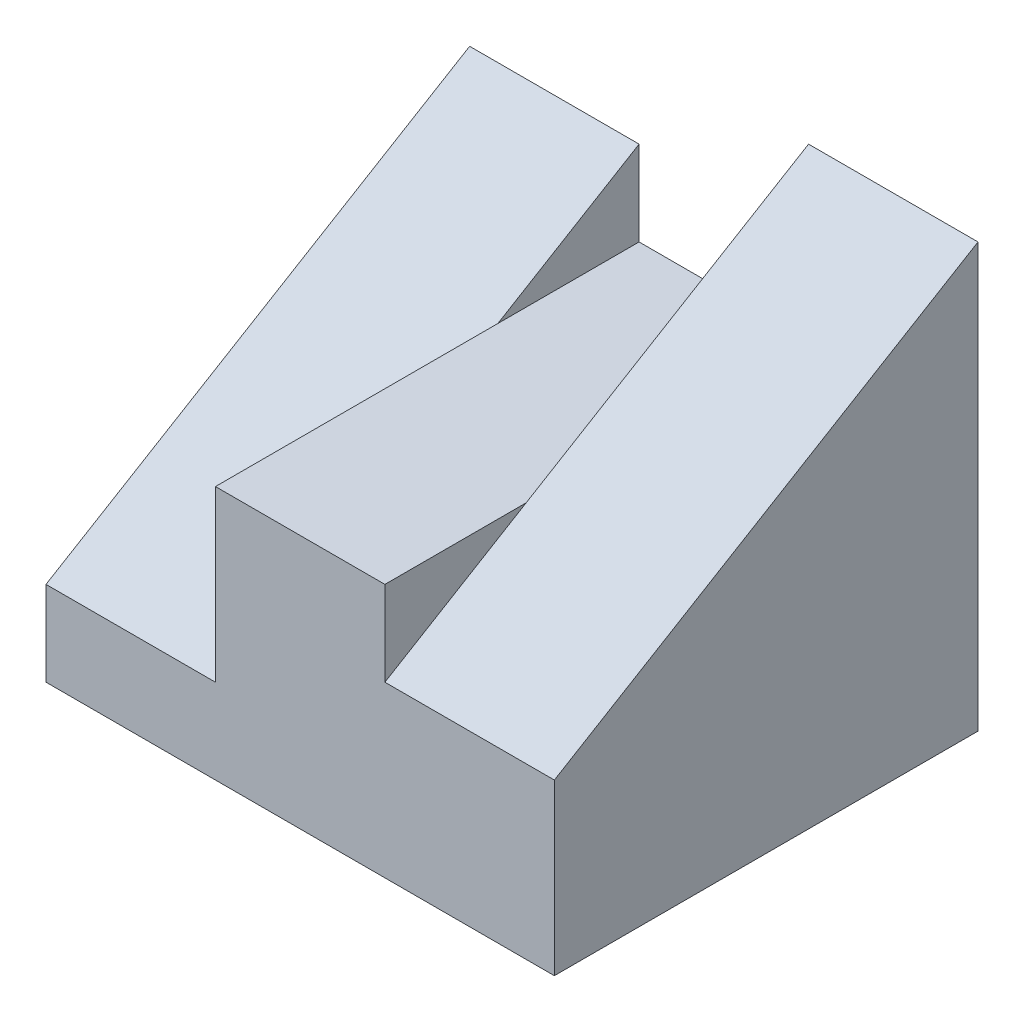
ISO-10303-21;
HEADER;
FILE_DESCRIPTION(('STEP AP214'),'2;1');
FILE_NAME('part.step','',(''),(''),'','','');
FILE_SCHEMA(('AUTOMOTIVE_DESIGN { 1 0 10303 214 1 1 1 1 }'));
ENDSEC;
DATA;
#1=APPLICATION_CONTEXT('core data for automotive mechanical design processes');
#2=APPLICATION_PROTOCOL_DEFINITION('international standard','automotive_design',2000,#1);
#3=PRODUCT_CONTEXT('',#1,'mechanical');
#4=PRODUCT('Part','Part','',(#3));
#5=PRODUCT_RELATED_PRODUCT_CATEGORY('part','',(#4));
#6=PRODUCT_DEFINITION_FORMATION('','',#4);
#7=PRODUCT_DEFINITION_CONTEXT('part definition',#1,'design');
#8=PRODUCT_DEFINITION('design','',#6,#7);
#9=PRODUCT_DEFINITION_SHAPE('','',#8);
#10=(LENGTH_UNIT() NAMED_UNIT(*) SI_UNIT(.MILLI.,.METRE.));
#11=(NAMED_UNIT(*) PLANE_ANGLE_UNIT() SI_UNIT($,.RADIAN.));
#12=(NAMED_UNIT(*) SI_UNIT($,.STERADIAN.) SOLID_ANGLE_UNIT());
#13=UNCERTAINTY_MEASURE_WITH_UNIT(LENGTH_MEASURE(1.E-05),#10,'distance_accuracy_value','');
#14=(GEOMETRIC_REPRESENTATION_CONTEXT(3) GLOBAL_UNCERTAINTY_ASSIGNED_CONTEXT((#13)) GLOBAL_UNIT_ASSIGNED_CONTEXT((#10,
#11,#12)) REPRESENTATION_CONTEXT('',''));
#15=CARTESIAN_POINT('',(0.,0.,0.));
#16=DIRECTION('',(0.,0.,1.));
#17=DIRECTION('',(1.,0.,0.));
#18=AXIS2_PLACEMENT_3D('',#15,#16,#17);
#19=CARTESIAN_POINT('',(-20.,5.,25.));
#20=DIRECTION('',(1.,0.,0.));
#21=DIRECTION('',(0.,0.,-1.));
#22=AXIS2_PLACEMENT_3D('',#19,#20,#21);
#23=PLANE('',#22);
#24=DIRECTION('',(0.,0.514495755427526,-0.857492925712544));
#25=VECTOR('',#24,1.);
#26=CARTESIAN_POINT('',(-20.,20.,0.));
#27=LINE('',#26,#25);
#28=CARTESIAN_POINT('',(-20.,5.,25.));
#29=VERTEX_POINT('',#28);
#30=CARTESIAN_POINT('',(-20.,15.,8.33333333333333));
#31=VERTEX_POINT('',#30);
#32=EDGE_CURVE('E196',#29,#31,#27,.T.);
#33=ORIENTED_EDGE('',*,*,#32,.F.);
#34=DIRECTION('',(0.,-1.,0.));
#35=VECTOR('',#34,1.);
#36=CARTESIAN_POINT('',(-20.,5.,25.));
#37=LINE('',#36,#35);
#38=CARTESIAN_POINT('',(-20.,15.,25.));
#39=VERTEX_POINT('',#38);
#40=EDGE_CURVE('E163',#39,#29,#37,.T.);
#41=ORIENTED_EDGE('',*,*,#40,.F.);
#42=DIRECTION('',(0.,0.,-1.));
#43=VECTOR('',#42,1.);
#44=CARTESIAN_POINT('',(-20.,15.,25.));
#45=LINE('',#44,#43);
#46=EDGE_CURVE('E167',#39,#31,#45,.T.);
#47=ORIENTED_EDGE('',*,*,#46,.T.);
#48=EDGE_LOOP('',(#33,#41,#47));
#49=FACE_BOUND('',#48,.T.);
#50=ADVANCED_FACE('F33',(#49),#23,.F.);
#51=CARTESIAN_POINT('',(-10.,15.,25.));
#52=DIRECTION('',(-1.,0.,0.));
#53=DIRECTION('',(0.,0.,1.));
#54=AXIS2_PLACEMENT_3D('',#51,#52,#53);
#55=PLANE('',#54);
#56=DIRECTION('',(0.,-0.514495755427526,0.857492925712544));
#57=VECTOR('',#56,1.);
#58=CARTESIAN_POINT('',(-10.,25.,0.));
#59=LINE('',#58,#57);
#60=CARTESIAN_POINT('',(-10.,15.,16.6666666666667));
#61=VERTEX_POINT('',#60);
#62=CARTESIAN_POINT('',(-10.,10.,25.));
#63=VERTEX_POINT('',#62);
#64=EDGE_CURVE('E56',#61,#63,#59,.T.);
#65=ORIENTED_EDGE('',*,*,#64,.F.);
#66=DIRECTION('',(0.,0.,-1.));
#67=VECTOR('',#66,1.);
#68=CARTESIAN_POINT('',(-10.,15.,25.));
#69=LINE('',#68,#67);
#70=CARTESIAN_POINT('',(-10.,15.,25.));
#71=VERTEX_POINT('',#70);
#72=EDGE_CURVE('E174',#71,#61,#69,.T.);
#73=ORIENTED_EDGE('',*,*,#72,.F.);
#74=DIRECTION('',(0.,1.,0.));
#75=VECTOR('',#74,1.);
#76=CARTESIAN_POINT('',(-10.,15.,25.));
#77=LINE('',#76,#75);
#78=EDGE_CURVE('E159',#63,#71,#77,.T.);
#79=ORIENTED_EDGE('',*,*,#78,.F.);
#80=EDGE_LOOP('',(#65,#73,#79));
#81=FACE_BOUND('',#80,.T.);
#82=ADVANCED_FACE('F190',(#81),#55,.F.);
#83=CARTESIAN_POINT('',(-30.,0.,25.));
#84=DIRECTION('',(1.,0.,0.));
#85=DIRECTION('',(0.,0.,-1.));
#86=AXIS2_PLACEMENT_3D('',#83,#84,#85);
#87=PLANE('',#86);
#88=DIRECTION('',(0.,-1.,0.));
#89=VECTOR('',#88,1.);
#90=CARTESIAN_POINT('',(-30.,0.,0.));
#91=LINE('',#90,#89);
#92=CARTESIAN_POINT('',(-30.,20.,0.));
#93=VERTEX_POINT('',#92);
#94=CARTESIAN_POINT('',(-30.,0.,0.));
#95=VERTEX_POINT('',#94);
#96=EDGE_CURVE('E107',#93,#95,#91,.T.);
#97=ORIENTED_EDGE('',*,*,#96,.T.);
#98=DIRECTION('',(0.,0.,-1.));
#99=VECTOR('',#98,1.);
#100=CARTESIAN_POINT('',(-30.,0.,25.));
#101=LINE('',#100,#99);
#102=CARTESIAN_POINT('',(-30.,0.,25.));
#103=VERTEX_POINT('',#102);
#104=EDGE_CURVE('E11',#103,#95,#101,.T.);
#105=ORIENTED_EDGE('',*,*,#104,.F.);
#106=DIRECTION('',(0.,-1.,0.));
#107=VECTOR('',#106,1.);
#108=CARTESIAN_POINT('',(-30.,0.,25.));
#109=LINE('',#108,#107);
#110=CARTESIAN_POINT('',(-30.,5.,25.));
#111=VERTEX_POINT('',#110);
#112=EDGE_CURVE('E124',#111,#103,#109,.T.);
#113=ORIENTED_EDGE('',*,*,#112,.F.);
#114=DIRECTION('',(0.,0.514495755427526,-0.857492925712544));
#115=VECTOR('',#114,1.);
#116=CARTESIAN_POINT('',(-30.,20.,0.));
#117=LINE('',#116,#115);
#118=EDGE_CURVE('E122',#111,#93,#117,.T.);
#119=ORIENTED_EDGE('',*,*,#118,.T.);
#120=EDGE_LOOP('',(#97,#105,#113,#119));
#121=FACE_BOUND('',#120,.T.);
#122=ADVANCED_FACE('F35',(#121),#87,.F.);
#123=CARTESIAN_POINT('',(0.,0.,25.));
#124=DIRECTION('',(0.,1.,0.));
#125=DIRECTION('',(-1.,0.,0.));
#126=AXIS2_PLACEMENT_3D('',#123,#124,#125);
#127=PLANE('',#126);
#128=DIRECTION('',(1.,0.,0.));
#129=VECTOR('',#128,1.);
#130=CARTESIAN_POINT('',(0.,0.,0.));
#131=LINE('',#130,#129);
#132=CARTESIAN_POINT('',(0.,0.,0.));
#133=VERTEX_POINT('',#132);
#134=EDGE_CURVE('E115',#95,#133,#131,.T.);
#135=ORIENTED_EDGE('',*,*,#134,.T.);
#136=DIRECTION('',(0.,0.,-1.));
#137=VECTOR('',#136,1.);
#138=CARTESIAN_POINT('',(0.,0.,25.));
#139=LINE('',#138,#137);
#140=CARTESIAN_POINT('',(0.,0.,25.));
#141=VERTEX_POINT('',#140);
#142=EDGE_CURVE('E41',#141,#133,#139,.T.);
#143=ORIENTED_EDGE('',*,*,#142,.F.);
#144=DIRECTION('',(1.,0.,0.));
#145=VECTOR('',#144,1.);
#146=CARTESIAN_POINT('',(0.,0.,25.));
#147=LINE('',#146,#145);
#148=EDGE_CURVE('E152',#103,#141,#147,.T.);
#149=ORIENTED_EDGE('',*,*,#148,.F.);
#150=ORIENTED_EDGE('',*,*,#104,.T.);
#151=EDGE_LOOP('',(#135,#143,#149,#150));
#152=FACE_BOUND('',#151,.T.);
#153=ADVANCED_FACE('F220',(#152),#127,.F.);
#154=CARTESIAN_POINT('',(0.,10.,25.));
#155=DIRECTION('',(-1.,0.,0.));
#156=DIRECTION('',(0.,-1.,0.));
#157=AXIS2_PLACEMENT_3D('',#154,#155,#156);
#158=PLANE('',#157);
#159=DIRECTION('',(0.,1.,0.));
#160=VECTOR('',#159,1.);
#161=CARTESIAN_POINT('',(0.,10.,0.));
#162=LINE('',#161,#160);
#163=CARTESIAN_POINT('',(0.,25.,0.));
#164=VERTEX_POINT('',#163);
#165=EDGE_CURVE('E170',#133,#164,#162,.T.);
#166=ORIENTED_EDGE('',*,*,#165,.T.);
#167=DIRECTION('',(0.,-0.514495755427526,0.857492925712544));
#168=VECTOR('',#167,1.);
#169=CARTESIAN_POINT('',(0.,25.,0.));
#170=LINE('',#169,#168);
#171=CARTESIAN_POINT('',(0.,10.,25.));
#172=VERTEX_POINT('',#171);
#173=EDGE_CURVE('E138',#164,#172,#170,.T.);
#174=ORIENTED_EDGE('',*,*,#173,.T.);
#175=DIRECTION('',(0.,1.,0.));
#176=VECTOR('',#175,1.);
#177=CARTESIAN_POINT('',(0.,10.,25.));
#178=LINE('',#177,#176);
#179=EDGE_CURVE('E155',#141,#172,#178,.T.);
#180=ORIENTED_EDGE('',*,*,#179,.F.);
#181=ORIENTED_EDGE('',*,*,#142,.T.);
#182=EDGE_LOOP('',(#166,#174,#180,#181));
#183=FACE_BOUND('',#182,.T.);
#184=ADVANCED_FACE('F179',(#183),#158,.F.);
#185=CARTESIAN_POINT('',(-20.,15.,25.));
#186=DIRECTION('',(0.,-1.,0.));
#187=DIRECTION('',(0.,0.,-1.));
#188=AXIS2_PLACEMENT_3D('',#185,#186,#187);
#189=PLANE('',#188);
#190=DIRECTION('',(-1.,0.,0.));
#191=VECTOR('',#190,1.);
#192=CARTESIAN_POINT('',(-20.,15.,0.));
#193=LINE('',#192,#191);
#194=CARTESIAN_POINT('',(-10.,15.,0.));
#195=VERTEX_POINT('',#194);
#196=CARTESIAN_POINT('',(-20.,15.,0.));
#197=VERTEX_POINT('',#196);
#198=EDGE_CURVE('E153',#195,#197,#193,.T.);
#199=ORIENTED_EDGE('',*,*,#198,.T.);
#200=DIRECTION('',(0.,0.,1.));
#201=VECTOR('',#200,1.);
#202=CARTESIAN_POINT('',(-20.,15.,25.));
#203=LINE('',#202,#201);
#204=EDGE_CURVE('E48',#197,#31,#203,.T.);
#205=ORIENTED_EDGE('',*,*,#204,.T.);
#206=ORIENTED_EDGE('',*,*,#46,.F.);
#207=DIRECTION('',(-1.,0.,0.));
#208=VECTOR('',#207,1.);
#209=CARTESIAN_POINT('',(-20.,15.,25.));
#210=LINE('',#209,#208);
#211=EDGE_CURVE('E161',#71,#39,#210,.T.);
#212=ORIENTED_EDGE('',*,*,#211,.F.);
#213=ORIENTED_EDGE('',*,*,#72,.T.);
#214=DIRECTION('',(0.,0.,-1.));
#215=VECTOR('',#214,1.);
#216=CARTESIAN_POINT('',(-10.,15.,25.));
#217=LINE('',#216,#215);
#218=EDGE_CURVE('E118',#61,#195,#217,.T.);
#219=ORIENTED_EDGE('',*,*,#218,.T.);
#220=EDGE_LOOP('',(#199,#205,#206,#212,#213,#219));
#221=FACE_BOUND('',#220,.T.);
#222=ADVANCED_FACE('F193',(#221),#189,.F.);
#223=CARTESIAN_POINT('',(0.,0.,25.));
#224=DIRECTION('',(0.,0.,-1.));
#225=DIRECTION('',(-1.,0.,0.));
#226=AXIS2_PLACEMENT_3D('',#223,#224,#225);
#227=PLANE('',#226);
#228=ORIENTED_EDGE('',*,*,#112,.T.);
#229=ORIENTED_EDGE('',*,*,#148,.T.);
#230=ORIENTED_EDGE('',*,*,#179,.T.);
#231=DIRECTION('',(-1.,0.,0.));
#232=VECTOR('',#231,1.);
#233=CARTESIAN_POINT('',(-10.,10.,25.));
#234=LINE('',#233,#232);
#235=EDGE_CURVE('E157',#172,#63,#234,.T.);
#236=ORIENTED_EDGE('',*,*,#235,.T.);
#237=ORIENTED_EDGE('',*,*,#78,.T.);
#238=ORIENTED_EDGE('',*,*,#211,.T.);
#239=ORIENTED_EDGE('',*,*,#40,.T.);
#240=DIRECTION('',(-1.,0.,0.));
#241=VECTOR('',#240,1.);
#242=CARTESIAN_POINT('',(-30.,5.,25.));
#243=LINE('',#242,#241);
#244=EDGE_CURVE('E166',#29,#111,#243,.T.);
#245=ORIENTED_EDGE('',*,*,#244,.T.);
#246=EDGE_LOOP('',(#228,#229,#230,#236,#237,#238,#239,#245));
#247=FACE_BOUND('',#246,.T.);
#248=ADVANCED_FACE('F189',(#247),#227,.F.);
#249=CARTESIAN_POINT('',(0.,0.,0.));
#250=DIRECTION('',(0.,0.,-1.));
#251=DIRECTION('',(-1.,0.,0.));
#252=AXIS2_PLACEMENT_3D('',#249,#250,#251);
#253=PLANE('',#252);
#254=ORIENTED_EDGE('',*,*,#96,.F.);
#255=DIRECTION('',(1.,0.,0.));
#256=VECTOR('',#255,1.);
#257=CARTESIAN_POINT('',(-30.,20.,0.));
#258=LINE('',#257,#256);
#259=CARTESIAN_POINT('',(-20.,20.,0.));
#260=VERTEX_POINT('',#259);
#261=EDGE_CURVE('E112',#93,#260,#258,.T.);
#262=ORIENTED_EDGE('',*,*,#261,.T.);
#263=DIRECTION('',(0.,-1.,0.));
#264=VECTOR('',#263,1.);
#265=CARTESIAN_POINT('',(-20.,5.,0.));
#266=LINE('',#265,#264);
#267=EDGE_CURVE('E127',#260,#197,#266,.T.);
#268=ORIENTED_EDGE('',*,*,#267,.T.);
#269=ORIENTED_EDGE('',*,*,#198,.F.);
#270=DIRECTION('',(0.,1.,0.));
#271=VECTOR('',#270,1.);
#272=CARTESIAN_POINT('',(-10.,10.,0.));
#273=LINE('',#272,#271);
#274=CARTESIAN_POINT('',(-10.,25.,0.));
#275=VERTEX_POINT('',#274);
#276=EDGE_CURVE('E142',#195,#275,#273,.T.);
#277=ORIENTED_EDGE('',*,*,#276,.T.);
#278=DIRECTION('',(-1.,0.,0.));
#279=VECTOR('',#278,1.);
#280=CARTESIAN_POINT('',(0.,25.,0.));
#281=LINE('',#280,#279);
#282=EDGE_CURVE('E141',#164,#275,#281,.T.);
#283=ORIENTED_EDGE('',*,*,#282,.F.);
#284=ORIENTED_EDGE('',*,*,#165,.F.);
#285=ORIENTED_EDGE('',*,*,#134,.F.);
#286=EDGE_LOOP('',(#254,#262,#268,#269,#277,#283,#284,#285));
#287=FACE_BOUND('',#286,.T.);
#288=ADVANCED_FACE('F109',(#287),#253,.T.);
#289=CARTESIAN_POINT('',(-10.,0.,0.));
#290=DIRECTION('',(-1.,0.,0.));
#291=DIRECTION('',(0.,0.,1.));
#292=AXIS2_PLACEMENT_3D('',#289,#290,#291);
#293=PLANE('',#292);
#294=ORIENTED_EDGE('',*,*,#218,.F.);
#295=EDGE_CURVE('E143',#275,#61,#59,.T.);
#296=ORIENTED_EDGE('',*,*,#295,.F.);
#297=ORIENTED_EDGE('',*,*,#276,.F.);
#298=EDGE_LOOP('',(#294,#296,#297));
#299=FACE_BOUND('',#298,.T.);
#300=ADVANCED_FACE('F206',(#299),#293,.T.);
#301=CARTESIAN_POINT('',(0.,25.,0.));
#302=DIRECTION('',(0.,-0.857492925712544,-0.514495755427526));
#303=DIRECTION('',(0.,0.514495755427526,-0.857492925712544));
#304=AXIS2_PLACEMENT_3D('',#301,#302,#303);
#305=PLANE('',#304);
#306=ORIENTED_EDGE('',*,*,#295,.T.);
#307=ORIENTED_EDGE('',*,*,#64,.T.);
#308=ORIENTED_EDGE('',*,*,#235,.F.);
#309=ORIENTED_EDGE('',*,*,#173,.F.);
#310=ORIENTED_EDGE('',*,*,#282,.T.);
#311=EDGE_LOOP('',(#306,#307,#308,#309,#310));
#312=FACE_BOUND('',#311,.T.);
#313=ADVANCED_FACE('F187',(#312),#305,.F.);
#314=CARTESIAN_POINT('',(-20.,0.,0.));
#315=DIRECTION('',(1.,0.,0.));
#316=DIRECTION('',(0.,0.,-1.));
#317=AXIS2_PLACEMENT_3D('',#314,#315,#316);
#318=PLANE('',#317);
#319=ORIENTED_EDGE('',*,*,#204,.F.);
#320=ORIENTED_EDGE('',*,*,#267,.F.);
#321=EDGE_CURVE('E132',#31,#260,#27,.T.);
#322=ORIENTED_EDGE('',*,*,#321,.F.);
#323=EDGE_LOOP('',(#319,#320,#322));
#324=FACE_BOUND('',#323,.T.);
#325=ADVANCED_FACE('F198',(#324),#318,.T.);
#326=CARTESIAN_POINT('',(-30.,20.,0.));
#327=DIRECTION('',(0.,-0.857492925712544,-0.514495755427526));
#328=DIRECTION('',(0.,0.514495755427526,-0.857492925712544));
#329=AXIS2_PLACEMENT_3D('',#326,#327,#328);
#330=PLANE('',#329);
#331=ORIENTED_EDGE('',*,*,#32,.T.);
#332=ORIENTED_EDGE('',*,*,#321,.T.);
#333=ORIENTED_EDGE('',*,*,#261,.F.);
#334=ORIENTED_EDGE('',*,*,#118,.F.);
#335=ORIENTED_EDGE('',*,*,#244,.F.);
#336=EDGE_LOOP('',(#331,#332,#333,#334,#335));
#337=FACE_BOUND('',#336,.T.);
#338=ADVANCED_FACE('F130',(#337),#330,.F.);
#339=CLOSED_SHELL('',(#50,#82,#122,#153,#184,#222,#248,#288,#300,#313,#325,#338));
#340=MANIFOLD_SOLID_BREP('B2',#339);
#341=ADVANCED_BREP_SHAPE_REPRESENTATION('',(#18,#340),#14);
#342=SHAPE_DEFINITION_REPRESENTATION(#9,#341);
ENDSEC;
END-ISO-10303-21;
